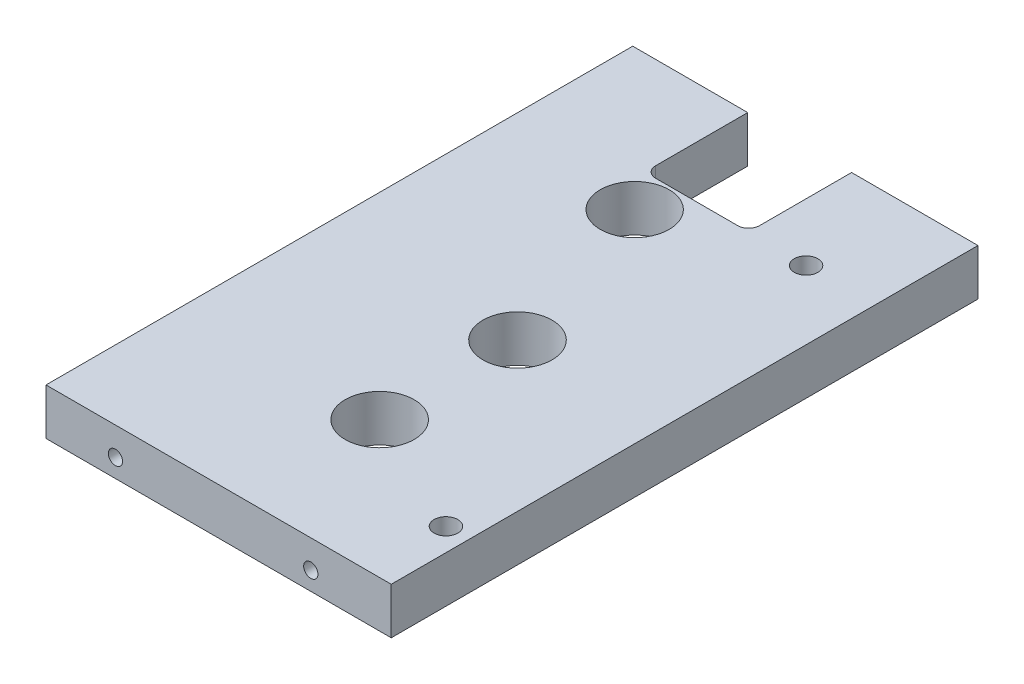
ISO-10303-21;
HEADER;
FILE_DESCRIPTION(('STEP AP214'),'2;1');
FILE_NAME('part.step','',(''),(''),'','','');
FILE_SCHEMA(('AUTOMOTIVE_DESIGN { 1 0 10303 214 1 1 1 1 }'));
ENDSEC;
DATA;
#1=APPLICATION_CONTEXT('core data for automotive mechanical design processes');
#2=APPLICATION_PROTOCOL_DEFINITION('international standard','automotive_design',2000,#1);
#3=PRODUCT_CONTEXT('',#1,'mechanical');
#4=PRODUCT('Part','Part','',(#3));
#5=PRODUCT_RELATED_PRODUCT_CATEGORY('part','',(#4));
#6=PRODUCT_DEFINITION_FORMATION('','',#4);
#7=PRODUCT_DEFINITION_CONTEXT('part definition',#1,'design');
#8=PRODUCT_DEFINITION('design','',#6,#7);
#9=PRODUCT_DEFINITION_SHAPE('','',#8);
#10=(LENGTH_UNIT() NAMED_UNIT(*) SI_UNIT(.MILLI.,.METRE.));
#11=(NAMED_UNIT(*) PLANE_ANGLE_UNIT() SI_UNIT($,.RADIAN.));
#12=(NAMED_UNIT(*) SI_UNIT($,.STERADIAN.) SOLID_ANGLE_UNIT());
#13=UNCERTAINTY_MEASURE_WITH_UNIT(LENGTH_MEASURE(1.E-05),#10,'distance_accuracy_value','');
#14=(GEOMETRIC_REPRESENTATION_CONTEXT(3) GLOBAL_UNCERTAINTY_ASSIGNED_CONTEXT((#13)) GLOBAL_UNIT_ASSIGNED_CONTEXT((#10,
#11,#12)) REPRESENTATION_CONTEXT('',''));
#15=CARTESIAN_POINT('',(0.,0.,0.));
#16=DIRECTION('',(0.,0.,1.));
#17=DIRECTION('',(1.,0.,0.));
#18=AXIS2_PLACEMENT_3D('',#15,#16,#17);
#19=CARTESIAN_POINT('',(-257.2,-82.5,28.9681240867132));
#20=DIRECTION('',(0.,0.,-1.));
#21=DIRECTION('',(-1.,0.,0.));
#22=AXIS2_PLACEMENT_3D('',#19,#20,#21);
#23=CYLINDRICAL_SURFACE('',#22,3.09999999999999);
#24=CARTESIAN_POINT('',(-257.2,-82.5,0.));
#25=DIRECTION('',(0.,0.,1.));
#26=DIRECTION('',(1.,0.,0.));
#27=AXIS2_PLACEMENT_3D('',#24,#25,#26);
#28=CIRCLE('',#27,3.09999999999999);
#29=CARTESIAN_POINT('',(-254.1,-82.5,0.));
#30=VERTEX_POINT('',#29);
#31=EDGE_CURVE('E219',#30,#30,#28,.T.);
#32=ORIENTED_EDGE('',*,*,#31,.F.);
#33=EDGE_LOOP('',(#32));
#34=FACE_BOUND('',#33,.T.);
#35=CARTESIAN_POINT('',(-257.2,-82.5,20.2));
#36=DIRECTION('',(0.,0.,1.));
#37=DIRECTION('',(1.,0.,0.));
#38=AXIS2_PLACEMENT_3D('',#35,#36,#37);
#39=CIRCLE('',#38,3.09999999999999);
#40=CARTESIAN_POINT('',(-256.848432083375,-85.58,20.2));
#41=VERTEX_POINT('',#40);
#42=CARTESIAN_POINT('',(-257.551567916625,-85.58,20.2));
#43=VERTEX_POINT('',#42);
#44=EDGE_CURVE('E140',#41,#43,#39,.T.);
#45=ORIENTED_EDGE('',*,*,#44,.T.);
#46=DIRECTION('',(0.,0.,-1.));
#47=VECTOR('',#46,1.);
#48=CARTESIAN_POINT('',(-257.551567916625,-85.58,28.9681240867132));
#49=LINE('',#48,#47);
#50=CARTESIAN_POINT('',(-257.551567916625,-85.58,19.8613272153188));
#51=VERTEX_POINT('',#50);
#52=EDGE_CURVE('E52',#43,#51,#49,.T.);
#53=ORIENTED_EDGE('',*,*,#52,.T.);
#54=CARTESIAN_POINT('',(-256.848432083375,-85.58,19.5693427331078));
#55=CARTESIAN_POINT('',(-256.907836533533,-85.5867825790089,19.5912680193791));
#56=CARTESIAN_POINT('',(-256.96719185592,-85.5918149847107,19.6138537564495));
#57=CARTESIAN_POINT('',(-257.085419115516,-85.5984451808167,19.6602024908549));
#58=CARTESIAN_POINT('',(-257.144291985608,-85.6000537146995,19.6839615656487));
#59=CARTESIAN_POINT('',(-257.261543057596,-85.599943539512,19.7326512016025));
#60=CARTESIAN_POINT('',(-257.319921276302,-85.5982249439608,19.7575817227653));
#61=CARTESIAN_POINT('',(-257.436197094981,-85.591539167004,19.8086127408628));
#62=CARTESIAN_POINT('',(-257.494092599788,-85.5865617621281,19.8347166781873));
#63=CARTESIAN_POINT('',(-257.551567916625,-85.58,19.8613272153188));
#64=B_SPLINE_CURVE_WITH_KNOTS('',3,(#54,#55,#56,#57,#58,#59,#60,#61,#62,#63),.UNSPECIFIED.,.F.,
.F.,(4,2,2,2,4),(0.,0.191016695142209,0.381433126124509,0.571843060357759,0.762853225634808),.UNSPECIFIED.);
#65=CARTESIAN_POINT('',(-256.848432083375,-85.58,19.5693427331078));
#66=VERTEX_POINT('',#65);
#67=EDGE_CURVE('E11',#66,#51,#64,.T.);
#68=ORIENTED_EDGE('',*,*,#67,.F.);
#69=DIRECTION('',(0.,0.,-1.));
#70=VECTOR('',#69,1.);
#71=CARTESIAN_POINT('',(-256.848432083375,-85.58,28.9681240867132));
#72=LINE('',#71,#70);
#73=EDGE_CURVE('E134',#66,#41,#72,.F.);
#74=ORIENTED_EDGE('',*,*,#73,.T.);
#75=EDGE_LOOP('',(#45,#53,#68,#74));
#76=FACE_BOUND('',#75,.T.);
#77=ADVANCED_FACE('F32',(#34,#76),#23,.F.);
#78=CARTESIAN_POINT('',(-282.25,-691.394504988286,20.2));
#79=DIRECTION('',(0.,0.,1.));
#80=DIRECTION('',(1.,0.,0.));
#81=AXIS2_PLACEMENT_3D('',#78,#79,#80);
#82=PLANE('',#81);
#83=DIRECTION('',(1.,0.,0.));
#84=VECTOR('',#83,1.);
#85=CARTESIAN_POINT('',(-282.25,-85.58,20.2));
#86=LINE('',#85,#84);
#87=EDGE_CURVE('E146',#43,#41,#86,.T.);
#88=ORIENTED_EDGE('',*,*,#87,.F.);
#89=ORIENTED_EDGE('',*,*,#44,.F.);
#90=EDGE_LOOP('',(#88,#89));
#91=FACE_BOUND('',#90,.T.);
#92=ADVANCED_FACE('F358',(#91),#82,.F.);
#93=CARTESIAN_POINT('',(-253.55,-88.901,28.505));
#94=DIRECTION('',(0.,1.,0.));
#95=DIRECTION('',(-1.,0.,0.));
#96=AXIS2_PLACEMENT_3D('',#93,#94,#95);
#97=CYLINDRICAL_SURFACE('',#96,3.26500000000004);
#98=CARTESIAN_POINT('',(-253.55,-76.1000000000001,28.505));
#99=DIRECTION('',(0.,1.,0.));
#100=DIRECTION('',(-1.,0.,0.));
#101=AXIS2_PLACEMENT_3D('',#98,#99,#100);
#102=CIRCLE('',#101,3.26500000000004);
#103=CARTESIAN_POINT('',(-256.815,-76.1000000000001,28.505));
#104=VERTEX_POINT('',#103);
#105=EDGE_CURVE('E151',#104,#104,#102,.T.);
#106=ORIENTED_EDGE('',*,*,#105,.T.);
#107=EDGE_LOOP('',(#106));
#108=FACE_BOUND('',#107,.T.);
#109=CARTESIAN_POINT('',(-253.55,-85.58,28.505));
#110=DIRECTION('',(0.,-1.,0.));
#111=DIRECTION('',(1.,0.,0.));
#112=AXIS2_PLACEMENT_3D('',#109,#110,#111);
#113=CIRCLE('',#112,3.26500000000004);
#114=CARTESIAN_POINT('',(-250.285,-85.58,28.505));
#115=VERTEX_POINT('',#114);
#116=EDGE_CURVE('E135',#115,#115,#113,.F.);
#117=ORIENTED_EDGE('',*,*,#116,.F.);
#118=EDGE_LOOP('',(#117));
#119=FACE_BOUND('',#118,.T.);
#120=ADVANCED_FACE('F363',(#108,#119),#97,.F.);
#121=CARTESIAN_POINT('',(-234.625,-76.1,0.));
#122=DIRECTION('',(0.,0.,1.));
#123=DIRECTION('',(1.,0.,0.));
#124=AXIS2_PLACEMENT_3D('',#121,#122,#123);
#125=PLANE('',#124);
#126=CARTESIAN_POINT('',(-320.5,-82.5,0.));
#127=DIRECTION('',(0.,0.,1.));
#128=DIRECTION('',(1.,0.,0.));
#129=AXIS2_PLACEMENT_3D('',#126,#127,#128);
#130=CIRCLE('',#129,2.39499999999998);
#131=CARTESIAN_POINT('',(-318.105,-82.5,0.));
#132=VERTEX_POINT('',#131);
#133=EDGE_CURVE('E207',#132,#132,#130,.T.);
#134=ORIENTED_EDGE('',*,*,#133,.T.);
#135=EDGE_LOOP('',(#134));
#136=FACE_BOUND('',#135,.T.);
#137=CARTESIAN_POINT('',(-308.,-82.5,0.));
#138=DIRECTION('',(0.,0.,1.));
#139=DIRECTION('',(1.,0.,0.));
#140=AXIS2_PLACEMENT_3D('',#137,#138,#139);
#141=CIRCLE('',#140,3.09999999999999);
#142=CARTESIAN_POINT('',(-304.9,-82.5,0.));
#143=VERTEX_POINT('',#142);
#144=EDGE_CURVE('E223',#143,#143,#141,.T.);
#145=ORIENTED_EDGE('',*,*,#144,.T.);
#146=EDGE_LOOP('',(#145));
#147=FACE_BOUND('',#146,.T.);
#148=DIRECTION('',(-1.,0.,0.));
#149=VECTOR('',#148,1.);
#150=CARTESIAN_POINT('',(-234.625,-76.1,0.));
#151=LINE('',#150,#149);
#152=CARTESIAN_POINT('',(-298.155,-76.1000000000001,0.));
#153=VERTEX_POINT('',#152);
#154=CARTESIAN_POINT('',(-329.875,-76.1000000000001,0.));
#155=VERTEX_POINT('',#154);
#156=EDGE_CURVE('E242',#153,#155,#151,.T.);
#157=ORIENTED_EDGE('',*,*,#156,.F.);
#158=DIRECTION('',(0.,1.,0.));
#159=VECTOR('',#158,1.);
#160=CARTESIAN_POINT('',(-298.155,-88.901,0.));
#161=LINE('',#160,#159);
#162=CARTESIAN_POINT('',(-298.155,-88.9,0.));
#163=VERTEX_POINT('',#162);
#164=EDGE_CURVE('E199',#163,#153,#161,.T.);
#165=ORIENTED_EDGE('',*,*,#164,.F.);
#166=DIRECTION('',(-1.,0.,0.));
#167=VECTOR('',#166,1.);
#168=CARTESIAN_POINT('',(-234.625,-88.8999999999999,0.));
#169=LINE('',#168,#167);
#170=CARTESIAN_POINT('',(-329.875,-88.9,0.));
#171=VERTEX_POINT('',#170);
#172=EDGE_CURVE('E234',#163,#171,#169,.T.);
#173=ORIENTED_EDGE('',*,*,#172,.T.);
#174=DIRECTION('',(0.,1.,0.));
#175=VECTOR('',#174,1.);
#176=CARTESIAN_POINT('',(-329.875,-88.9,0.));
#177=LINE('',#176,#175);
#178=EDGE_CURVE('E233',#171,#155,#177,.T.);
#179=ORIENTED_EDGE('',*,*,#178,.T.);
#180=EDGE_LOOP('',(#157,#165,#173,#179));
#181=FACE_BOUND('',#180,.T.);
#182=ADVANCED_FACE('F322',(#136,#147,#181),#125,.F.);
#183=CARTESIAN_POINT('',(-244.2,-82.5,0.));
#184=DIRECTION('',(0.,0.,1.));
#185=DIRECTION('',(1.,0.,0.));
#186=AXIS2_PLACEMENT_3D('',#183,#184,#185);
#187=CIRCLE('',#186,2.39499999999998);
#188=CARTESIAN_POINT('',(-241.805,-82.5,0.));
#189=VERTEX_POINT('',#188);
#190=EDGE_CURVE('E213',#189,#189,#187,.T.);
#191=ORIENTED_EDGE('',*,*,#190,.T.);
#192=EDGE_LOOP('',(#191));
#193=FACE_BOUND('',#192,.T.);
#194=CARTESIAN_POINT('',(-234.625,-88.8999999999999,0.));
#195=VERTEX_POINT('',#194);
#196=CARTESIAN_POINT('',(-269.505,-88.8999999999999,0.));
#197=VERTEX_POINT('',#196);
#198=EDGE_CURVE('E230',#195,#197,#169,.T.);
#199=ORIENTED_EDGE('',*,*,#198,.T.);
#200=DIRECTION('',(0.,1.,0.));
#201=VECTOR('',#200,1.);
#202=CARTESIAN_POINT('',(-269.505,-88.901,0.));
#203=LINE('',#202,#201);
#204=CARTESIAN_POINT('',(-269.505,-76.1000000000001,0.));
#205=VERTEX_POINT('',#204);
#206=EDGE_CURVE('E201',#197,#205,#203,.T.);
#207=ORIENTED_EDGE('',*,*,#206,.T.);
#208=CARTESIAN_POINT('',(-234.625,-76.1,0.));
#209=VERTEX_POINT('',#208);
#210=EDGE_CURVE('E238',#209,#205,#151,.T.);
#211=ORIENTED_EDGE('',*,*,#210,.F.);
#212=DIRECTION('',(0.,1.,0.));
#213=VECTOR('',#212,1.);
#214=CARTESIAN_POINT('',(-234.625,-88.8999999999999,0.));
#215=LINE('',#214,#213);
#216=EDGE_CURVE('E45',#195,#209,#215,.T.);
#217=ORIENTED_EDGE('',*,*,#216,.F.);
#218=EDGE_LOOP('',(#199,#207,#211,#217));
#219=FACE_BOUND('',#218,.T.);
#220=ORIENTED_EDGE('',*,*,#31,.T.);
#221=EDGE_LOOP('',(#220));
#222=FACE_BOUND('',#221,.T.);
#223=ADVANCED_FACE('F338',(#193,#219,#222),#125,.F.);
#224=CARTESIAN_POINT('',(-329.875,-610.1,161.88));
#225=DIRECTION('',(0.,0.,1.));
#226=DIRECTION('',(1.,0.,0.));
#227=AXIS2_PLACEMENT_3D('',#224,#225,#226);
#228=PLANE('',#227);
#229=CARTESIAN_POINT('',(-310.715,-83.83,161.88));
#230=DIRECTION('',(0.,0.,1.));
#231=DIRECTION('',(1.,0.,0.));
#232=AXIS2_PLACEMENT_3D('',#229,#230,#231);
#233=CIRCLE('',#232,1.965);
#234=CARTESIAN_POINT('',(-308.75,-83.83,161.88));
#235=VERTEX_POINT('',#234);
#236=EDGE_CURVE('E275',#235,#235,#233,.T.);
#237=ORIENTED_EDGE('',*,*,#236,.F.);
#238=EDGE_LOOP('',(#237));
#239=FACE_BOUND('',#238,.T.);
#240=CARTESIAN_POINT('',(-256.825,-83.83,161.88));
#241=DIRECTION('',(0.,0.,1.));
#242=DIRECTION('',(1.,0.,0.));
#243=AXIS2_PLACEMENT_3D('',#240,#241,#242);
#244=CIRCLE('',#243,1.965);
#245=CARTESIAN_POINT('',(-254.86,-83.83,161.88));
#246=VERTEX_POINT('',#245);
#247=EDGE_CURVE('E269',#246,#246,#244,.T.);
#248=ORIENTED_EDGE('',*,*,#247,.F.);
#249=EDGE_LOOP('',(#248));
#250=FACE_BOUND('',#249,.T.);
#251=DIRECTION('',(-1.,0.,0.));
#252=VECTOR('',#251,1.);
#253=CARTESIAN_POINT('',(-234.625,-88.8999999999999,161.88));
#254=LINE('',#253,#252);
#255=CARTESIAN_POINT('',(-234.625,-88.8999999999999,161.88));
#256=VERTEX_POINT('',#255);
#257=CARTESIAN_POINT('',(-329.875,-88.9,161.88));
#258=VERTEX_POINT('',#257);
#259=EDGE_CURVE('E237',#256,#258,#254,.T.);
#260=ORIENTED_EDGE('',*,*,#259,.F.);
#261=DIRECTION('',(0.,1.,0.));
#262=VECTOR('',#261,1.);
#263=CARTESIAN_POINT('',(-234.625,-88.8999999999999,161.88));
#264=LINE('',#263,#262);
#265=CARTESIAN_POINT('',(-234.625,-76.1,161.88));
#266=VERTEX_POINT('',#265);
#267=EDGE_CURVE('E229',#256,#266,#264,.T.);
#268=ORIENTED_EDGE('',*,*,#267,.T.);
#269=DIRECTION('',(-1.,0.,0.));
#270=VECTOR('',#269,1.);
#271=CARTESIAN_POINT('',(-234.625,-76.1,161.88));
#272=LINE('',#271,#270);
#273=CARTESIAN_POINT('',(-329.875,-76.1000000000001,161.88));
#274=VERTEX_POINT('',#273);
#275=EDGE_CURVE('E249',#266,#274,#272,.T.);
#276=ORIENTED_EDGE('',*,*,#275,.T.);
#277=DIRECTION('',(0.,1.,0.));
#278=VECTOR('',#277,1.);
#279=CARTESIAN_POINT('',(-329.875,-88.9,161.88));
#280=LINE('',#279,#278);
#281=EDGE_CURVE('E251',#258,#274,#280,.T.);
#282=ORIENTED_EDGE('',*,*,#281,.F.);
#283=EDGE_LOOP('',(#260,#268,#276,#282));
#284=FACE_BOUND('',#283,.T.);
#285=ADVANCED_FACE('F34',(#239,#250,#284),#228,.T.);
#286=CARTESIAN_POINT('',(-234.625,-88.8999999999999,257.98620427423));
#287=DIRECTION('',(0.,-1.,0.));
#288=DIRECTION('',(1.,0.,0.));
#289=AXIS2_PLACEMENT_3D('',#286,#287,#288);
#290=PLANE('',#289);
#291=CARTESIAN_POINT('',(-290.57,-88.9,38.77));
#292=DIRECTION('',(0.,1.,0.));
#293=DIRECTION('',(-1.,0.,0.));
#294=AXIS2_PLACEMENT_3D('',#291,#292,#293);
#295=CIRCLE('',#294,9.50000000000001);
#296=CARTESIAN_POINT('',(-300.07,-88.9,38.77));
#297=VERTEX_POINT('',#296);
#298=EDGE_CURVE('E278',#297,#297,#295,.T.);
#299=ORIENTED_EDGE('',*,*,#298,.T.);
#300=EDGE_LOOP('',(#299));
#301=FACE_BOUND('',#300,.T.);
#302=CARTESIAN_POINT('',(-253.55,-88.9,28.505));
#303=DIRECTION('',(0.,-1.,0.));
#304=DIRECTION('',(1.,0.,0.));
#305=AXIS2_PLACEMENT_3D('',#302,#303,#304);
#306=CIRCLE('',#305,9.52500000000002);
#307=CARTESIAN_POINT('',(-244.025,-88.9,28.505));
#308=VERTEX_POINT('',#307);
#309=EDGE_CURVE('E136',#308,#308,#306,.T.);
#310=ORIENTED_EDGE('',*,*,#309,.F.);
#311=EDGE_LOOP('',(#310));
#312=FACE_BOUND('',#311,.T.);
#313=CARTESIAN_POINT('',(-240.925,-88.8999999999999,140.49));
#314=DIRECTION('',(0.,-1.,0.));
#315=DIRECTION('',(1.,0.,0.));
#316=AXIS2_PLACEMENT_3D('',#313,#314,#315);
#317=CIRCLE('',#316,3.26500000000004);
#318=CARTESIAN_POINT('',(-237.66,-88.8999999999999,140.49));
#319=VERTEX_POINT('',#318);
#320=EDGE_CURVE('E141',#319,#319,#317,.F.);
#321=ORIENTED_EDGE('',*,*,#320,.T.);
#322=EDGE_LOOP('',(#321));
#323=FACE_BOUND('',#322,.T.);
#324=CARTESIAN_POINT('',(-275.57,-88.8999999999999,124.135));
#325=DIRECTION('',(0.,-1.,0.));
#326=DIRECTION('',(1.,0.,0.));
#327=AXIS2_PLACEMENT_3D('',#324,#325,#326);
#328=CIRCLE('',#327,9.52500000000002);
#329=CARTESIAN_POINT('',(-266.045,-88.8999999999999,124.135));
#330=VERTEX_POINT('',#329);
#331=EDGE_CURVE('E155',#330,#330,#328,.F.);
#332=ORIENTED_EDGE('',*,*,#331,.T.);
#333=EDGE_LOOP('',(#332));
#334=FACE_BOUND('',#333,.T.);
#335=CARTESIAN_POINT('',(-275.57,-88.8999999999999,86.105));
#336=DIRECTION('',(0.,-1.,0.));
#337=DIRECTION('',(1.,0.,0.));
#338=AXIS2_PLACEMENT_3D('',#335,#336,#337);
#339=CIRCLE('',#338,9.52500000000002);
#340=CARTESIAN_POINT('',(-266.045,-88.8999999999999,86.105));
#341=VERTEX_POINT('',#340);
#342=EDGE_CURVE('E159',#341,#341,#339,.F.);
#343=ORIENTED_EDGE('',*,*,#342,.T.);
#344=EDGE_LOOP('',(#343));
#345=FACE_BOUND('',#344,.T.);
#346=DIRECTION('',(0.,0.,1.));
#347=VECTOR('',#346,1.);
#348=CARTESIAN_POINT('',(-298.155,-88.9,0.));
#349=LINE('',#348,#347);
#350=CARTESIAN_POINT('',(-298.155,-88.9,25.4));
#351=VERTEX_POINT('',#350);
#352=EDGE_CURVE('E176',#163,#351,#349,.T.);
#353=ORIENTED_EDGE('',*,*,#352,.T.);
#354=CARTESIAN_POINT('',(-295.155,-88.9,25.4));
#355=DIRECTION('',(0.,-1.,0.));
#356=DIRECTION('',(1.,0.,0.));
#357=AXIS2_PLACEMENT_3D('',#354,#355,#356);
#358=CIRCLE('',#357,3.);
#359=CARTESIAN_POINT('',(-295.155,-88.9,28.4));
#360=VERTEX_POINT('',#359);
#361=EDGE_CURVE('E173',#351,#360,#358,.F.);
#362=ORIENTED_EDGE('',*,*,#361,.T.);
#363=DIRECTION('',(1.,0.,0.));
#364=VECTOR('',#363,1.);
#365=CARTESIAN_POINT('',(-295.155,-88.9,28.4));
#366=LINE('',#365,#364);
#367=CARTESIAN_POINT('',(-272.505,-88.8999999999999,28.4));
#368=VERTEX_POINT('',#367);
#369=EDGE_CURVE('E170',#360,#368,#366,.T.);
#370=ORIENTED_EDGE('',*,*,#369,.T.);
#371=CARTESIAN_POINT('',(-272.505,-88.8999999999999,25.4));
#372=DIRECTION('',(0.,-1.,0.));
#373=DIRECTION('',(1.,0.,0.));
#374=AXIS2_PLACEMENT_3D('',#371,#372,#373);
#375=CIRCLE('',#374,3.);
#376=CARTESIAN_POINT('',(-269.505,-88.8999999999999,25.4));
#377=VERTEX_POINT('',#376);
#378=EDGE_CURVE('E165',#368,#377,#375,.F.);
#379=ORIENTED_EDGE('',*,*,#378,.T.);
#380=DIRECTION('',(0.,0.,-1.));
#381=VECTOR('',#380,1.);
#382=CARTESIAN_POINT('',(-269.505,-88.8999999999999,25.4));
#383=LINE('',#382,#381);
#384=EDGE_CURVE('E194',#377,#197,#383,.T.);
#385=ORIENTED_EDGE('',*,*,#384,.T.);
#386=ORIENTED_EDGE('',*,*,#198,.F.);
#387=DIRECTION('',(0.,0.,-1.));
#388=VECTOR('',#387,1.);
#389=CARTESIAN_POINT('',(-234.625,-88.8999999999999,257.98620427423));
#390=LINE('',#389,#388);
#391=EDGE_CURVE('E241',#256,#195,#390,.T.);
#392=ORIENTED_EDGE('',*,*,#391,.F.);
#393=ORIENTED_EDGE('',*,*,#259,.T.);
#394=DIRECTION('',(0.,0.,-1.));
#395=VECTOR('',#394,1.);
#396=CARTESIAN_POINT('',(-329.875,-88.9,257.98620427423));
#397=LINE('',#396,#395);
#398=EDGE_CURVE('E247',#258,#171,#397,.T.);
#399=ORIENTED_EDGE('',*,*,#398,.T.);
#400=ORIENTED_EDGE('',*,*,#172,.F.);
#401=EDGE_LOOP('',(#353,#362,#370,#379,#385,#386,#392,#393,#399,#400));
#402=FACE_BOUND('',#401,.T.);
#403=ADVANCED_FACE('F285',(#301,#312,#323,#334,#345,#402),#290,.T.);
#404=CARTESIAN_POINT('',(-329.875,-88.9,257.98620427423));
#405=DIRECTION('',(-1.,0.,0.));
#406=DIRECTION('',(0.,0.,1.));
#407=AXIS2_PLACEMENT_3D('',#404,#405,#406);
#408=PLANE('',#407);
#409=ORIENTED_EDGE('',*,*,#398,.F.);
#410=ORIENTED_EDGE('',*,*,#281,.T.);
#411=DIRECTION('',(0.,0.,-1.));
#412=VECTOR('',#411,1.);
#413=CARTESIAN_POINT('',(-329.875,-76.1000000000001,257.98620427423));
#414=LINE('',#413,#412);
#415=EDGE_CURVE('E254',#274,#155,#414,.T.);
#416=ORIENTED_EDGE('',*,*,#415,.T.);
#417=ORIENTED_EDGE('',*,*,#178,.F.);
#418=EDGE_LOOP('',(#409,#410,#416,#417));
#419=FACE_BOUND('',#418,.T.);
#420=ADVANCED_FACE('F299',(#419),#408,.T.);
#421=CARTESIAN_POINT('',(-234.625,-76.1,257.98620427423));
#422=DIRECTION('',(0.,-1.,0.));
#423=DIRECTION('',(1.,0.,0.));
#424=AXIS2_PLACEMENT_3D('',#421,#422,#423);
#425=PLANE('',#424);
#426=CARTESIAN_POINT('',(-290.57,-76.1000000000001,38.77));
#427=DIRECTION('',(0.,1.,0.));
#428=DIRECTION('',(-1.,0.,0.));
#429=AXIS2_PLACEMENT_3D('',#426,#427,#428);
#430=CIRCLE('',#429,9.50000000000001);
#431=CARTESIAN_POINT('',(-300.07,-76.1000000000001,38.77));
#432=VERTEX_POINT('',#431);
#433=EDGE_CURVE('E279',#432,#432,#430,.T.);
#434=ORIENTED_EDGE('',*,*,#433,.F.);
#435=EDGE_LOOP('',(#434));
#436=FACE_BOUND('',#435,.T.);
#437=CARTESIAN_POINT('',(-240.925,-76.1000000000001,140.49));
#438=DIRECTION('',(0.,1.,0.));
#439=DIRECTION('',(-1.,0.,0.));
#440=AXIS2_PLACEMENT_3D('',#437,#438,#439);
#441=CIRCLE('',#440,3.26500000000004);
#442=CARTESIAN_POINT('',(-244.19,-76.1000000000001,140.49));
#443=VERTEX_POINT('',#442);
#444=EDGE_CURVE('E144',#443,#443,#441,.T.);
#445=ORIENTED_EDGE('',*,*,#444,.F.);
#446=EDGE_LOOP('',(#445));
#447=FACE_BOUND('',#446,.T.);
#448=ORIENTED_EDGE('',*,*,#105,.F.);
#449=EDGE_LOOP('',(#448));
#450=FACE_BOUND('',#449,.T.);
#451=CARTESIAN_POINT('',(-275.57,-76.1000000000001,124.135));
#452=DIRECTION('',(0.,1.,0.));
#453=DIRECTION('',(-1.,0.,0.));
#454=AXIS2_PLACEMENT_3D('',#451,#452,#453);
#455=CIRCLE('',#454,9.52500000000002);
#456=CARTESIAN_POINT('',(-285.095,-76.1000000000001,124.135));
#457=VERTEX_POINT('',#456);
#458=EDGE_CURVE('E156',#457,#457,#455,.T.);
#459=ORIENTED_EDGE('',*,*,#458,.F.);
#460=EDGE_LOOP('',(#459));
#461=FACE_BOUND('',#460,.T.);
#462=CARTESIAN_POINT('',(-275.57,-76.1000000000001,86.105));
#463=DIRECTION('',(0.,1.,0.));
#464=DIRECTION('',(-1.,0.,0.));
#465=AXIS2_PLACEMENT_3D('',#462,#463,#464);
#466=CIRCLE('',#465,9.52500000000002);
#467=CARTESIAN_POINT('',(-285.095,-76.1000000000001,86.105));
#468=VERTEX_POINT('',#467);
#469=EDGE_CURVE('E162',#468,#468,#466,.T.);
#470=ORIENTED_EDGE('',*,*,#469,.F.);
#471=EDGE_LOOP('',(#470));
#472=FACE_BOUND('',#471,.T.);
#473=CARTESIAN_POINT('',(-295.155,-76.1000000000001,25.4));
#474=DIRECTION('',(0.,1.,0.));
#475=DIRECTION('',(-1.,0.,0.));
#476=AXIS2_PLACEMENT_3D('',#473,#474,#475);
#477=CIRCLE('',#476,3.);
#478=CARTESIAN_POINT('',(-298.155,-76.1000000000001,25.4));
#479=VERTEX_POINT('',#478);
#480=CARTESIAN_POINT('',(-295.155,-76.1000000000001,28.4));
#481=VERTEX_POINT('',#480);
#482=EDGE_CURVE('E185',#479,#481,#477,.T.);
#483=ORIENTED_EDGE('',*,*,#482,.F.);
#484=DIRECTION('',(0.,0.,1.));
#485=VECTOR('',#484,1.);
#486=CARTESIAN_POINT('',(-298.155,-76.1000000000001,0.));
#487=LINE('',#486,#485);
#488=EDGE_CURVE('E182',#153,#479,#487,.T.);
#489=ORIENTED_EDGE('',*,*,#488,.F.);
#490=ORIENTED_EDGE('',*,*,#156,.T.);
#491=ORIENTED_EDGE('',*,*,#415,.F.);
#492=ORIENTED_EDGE('',*,*,#275,.F.);
#493=DIRECTION('',(0.,0.,-1.));
#494=VECTOR('',#493,1.);
#495=CARTESIAN_POINT('',(-234.625,-76.1,257.98620427423));
#496=LINE('',#495,#494);
#497=EDGE_CURVE('E255',#266,#209,#496,.T.);
#498=ORIENTED_EDGE('',*,*,#497,.T.);
#499=ORIENTED_EDGE('',*,*,#210,.T.);
#500=DIRECTION('',(0.,0.,-1.));
#501=VECTOR('',#500,1.);
#502=CARTESIAN_POINT('',(-269.505,-76.1000000000001,25.4));
#503=LINE('',#502,#501);
#504=CARTESIAN_POINT('',(-269.505,-76.1,25.4));
#505=VERTEX_POINT('',#504);
#506=EDGE_CURVE('E180',#505,#205,#503,.T.);
#507=ORIENTED_EDGE('',*,*,#506,.F.);
#508=CARTESIAN_POINT('',(-272.505,-76.1000000000001,25.4));
#509=DIRECTION('',(0.,1.,0.));
#510=DIRECTION('',(-1.,0.,0.));
#511=AXIS2_PLACEMENT_3D('',#508,#509,#510);
#512=CIRCLE('',#511,3.);
#513=CARTESIAN_POINT('',(-272.505,-76.1000000000001,28.4));
#514=VERTEX_POINT('',#513);
#515=EDGE_CURVE('E60',#514,#505,#512,.T.);
#516=ORIENTED_EDGE('',*,*,#515,.F.);
#517=DIRECTION('',(1.,0.,0.));
#518=VECTOR('',#517,1.);
#519=CARTESIAN_POINT('',(-295.155,-76.1000000000001,28.4));
#520=LINE('',#519,#518);
#521=EDGE_CURVE('E188',#481,#514,#520,.T.);
#522=ORIENTED_EDGE('',*,*,#521,.F.);
#523=EDGE_LOOP('',(#483,#489,#490,#491,#492,#498,#499,#507,#516,#522));
#524=FACE_BOUND('',#523,.T.);
#525=ADVANCED_FACE('F295',(#436,#447,#450,#461,#472,#524),#425,.F.);
#526=CARTESIAN_POINT('',(-234.625,-88.8999999999999,257.98620427423));
#527=DIRECTION('',(-1.,0.,0.));
#528=DIRECTION('',(0.,0.,1.));
#529=AXIS2_PLACEMENT_3D('',#526,#527,#528);
#530=PLANE('',#529);
#531=ORIENTED_EDGE('',*,*,#267,.F.);
#532=ORIENTED_EDGE('',*,*,#391,.T.);
#533=ORIENTED_EDGE('',*,*,#216,.T.);
#534=ORIENTED_EDGE('',*,*,#497,.F.);
#535=EDGE_LOOP('',(#531,#532,#533,#534));
#536=FACE_BOUND('',#535,.T.);
#537=ADVANCED_FACE('F298',(#536),#530,.F.);
#538=CARTESIAN_POINT('',(-308.,-82.5,28.9681240867132));
#539=DIRECTION('',(0.,0.,-1.));
#540=DIRECTION('',(-1.,0.,0.));
#541=AXIS2_PLACEMENT_3D('',#538,#539,#540);
#542=CYLINDRICAL_SURFACE('',#541,3.09999999999999);
#543=ORIENTED_EDGE('',*,*,#144,.F.);
#544=EDGE_LOOP('',(#543));
#545=FACE_BOUND('',#544,.T.);
#546=CARTESIAN_POINT('',(-308.,-82.5,20.2));
#547=DIRECTION('',(0.,0.,1.));
#548=DIRECTION('',(1.,0.,0.));
#549=AXIS2_PLACEMENT_3D('',#546,#547,#548);
#550=CIRCLE('',#549,3.09999999999999);
#551=CARTESIAN_POINT('',(-304.9,-82.5,20.2));
#552=VERTEX_POINT('',#551);
#553=EDGE_CURVE('E226',#552,#552,#550,.T.);
#554=ORIENTED_EDGE('',*,*,#553,.T.);
#555=EDGE_LOOP('',(#554));
#556=FACE_BOUND('',#555,.T.);
#557=ADVANCED_FACE('F372',(#545,#556),#542,.F.);
#558=CARTESIAN_POINT('',(-282.25,-691.394504988286,20.2));
#559=DIRECTION('',(0.,0.,1.));
#560=DIRECTION('',(1.,0.,0.));
#561=AXIS2_PLACEMENT_3D('',#558,#559,#560);
#562=PLANE('',#561);
#563=ORIENTED_EDGE('',*,*,#553,.F.);
#564=EDGE_LOOP('',(#563));
#565=FACE_BOUND('',#564,.T.);
#566=ADVANCED_FACE('F375',(#565),#562,.F.);
#567=CARTESIAN_POINT('',(-244.2,-82.5,28.2740829637671));
#568=DIRECTION('',(0.,0.,-1.));
#569=DIRECTION('',(-1.,0.,0.));
#570=AXIS2_PLACEMENT_3D('',#567,#568,#569);
#571=CYLINDRICAL_SURFACE('',#570,2.39499999999998);
#572=ORIENTED_EDGE('',*,*,#190,.F.);
#573=EDGE_LOOP('',(#572));
#574=FACE_BOUND('',#573,.T.);
#575=CARTESIAN_POINT('',(-244.2,-82.5,21.5));
#576=DIRECTION('',(0.,0.,1.));
#577=DIRECTION('',(1.,0.,0.));
#578=AXIS2_PLACEMENT_3D('',#575,#576,#577);
#579=CIRCLE('',#578,2.39499999999998);
#580=CARTESIAN_POINT('',(-241.805,-82.5,21.5));
#581=VERTEX_POINT('',#580);
#582=EDGE_CURVE('E216',#581,#581,#579,.T.);
#583=ORIENTED_EDGE('',*,*,#582,.T.);
#584=EDGE_LOOP('',(#583));
#585=FACE_BOUND('',#584,.T.);
#586=ADVANCED_FACE('F379',(#574,#585),#571,.F.);
#587=CARTESIAN_POINT('',(-282.25,-691.394504988286,21.5));
#588=DIRECTION('',(0.,0.,1.));
#589=DIRECTION('',(1.,0.,0.));
#590=AXIS2_PLACEMENT_3D('',#587,#588,#589);
#591=PLANE('',#590);
#592=ORIENTED_EDGE('',*,*,#582,.F.);
#593=EDGE_LOOP('',(#592));
#594=FACE_BOUND('',#593,.T.);
#595=ADVANCED_FACE('F369',(#594),#591,.F.);
#596=CARTESIAN_POINT('',(-320.5,-82.5,28.2740829637671));
#597=DIRECTION('',(0.,0.,-1.));
#598=DIRECTION('',(-1.,0.,0.));
#599=AXIS2_PLACEMENT_3D('',#596,#597,#598);
#600=CYLINDRICAL_SURFACE('',#599,2.39499999999998);
#601=ORIENTED_EDGE('',*,*,#133,.F.);
#602=EDGE_LOOP('',(#601));
#603=FACE_BOUND('',#602,.T.);
#604=CARTESIAN_POINT('',(-320.5,-82.5,21.5));
#605=DIRECTION('',(0.,0.,1.));
#606=DIRECTION('',(1.,0.,0.));
#607=AXIS2_PLACEMENT_3D('',#604,#605,#606);
#608=CIRCLE('',#607,2.39499999999998);
#609=CARTESIAN_POINT('',(-318.105,-82.5,21.5));
#610=VERTEX_POINT('',#609);
#611=EDGE_CURVE('E210',#610,#610,#608,.T.);
#612=ORIENTED_EDGE('',*,*,#611,.T.);
#613=EDGE_LOOP('',(#612));
#614=FACE_BOUND('',#613,.T.);
#615=ADVANCED_FACE('F440',(#603,#614),#600,.F.);
#616=CARTESIAN_POINT('',(-282.25,-691.394504988286,21.5));
#617=DIRECTION('',(0.,0.,1.));
#618=DIRECTION('',(1.,0.,0.));
#619=AXIS2_PLACEMENT_3D('',#616,#617,#618);
#620=PLANE('',#619);
#621=ORIENTED_EDGE('',*,*,#611,.F.);
#622=EDGE_LOOP('',(#621));
#623=FACE_BOUND('',#622,.T.);
#624=ADVANCED_FACE('F354',(#623),#620,.F.);
#625=CARTESIAN_POINT('',(-272.505,-88.901,25.4));
#626=DIRECTION('',(0.,1.,0.));
#627=DIRECTION('',(-1.,0.,0.));
#628=AXIS2_PLACEMENT_3D('',#625,#626,#627);
#629=CYLINDRICAL_SURFACE('',#628,3.);
#630=DIRECTION('',(0.,1.,0.));
#631=VECTOR('',#630,1.);
#632=CARTESIAN_POINT('',(-272.505,-88.901,28.4));
#633=LINE('',#632,#631);
#634=EDGE_CURVE('E192',#368,#514,#633,.T.);
#635=ORIENTED_EDGE('',*,*,#634,.T.);
#636=ORIENTED_EDGE('',*,*,#515,.T.);
#637=DIRECTION('',(0.,1.,0.));
#638=VECTOR('',#637,1.);
#639=CARTESIAN_POINT('',(-269.505,-88.901,25.4));
#640=LINE('',#639,#638);
#641=EDGE_CURVE('E191',#377,#505,#640,.T.);
#642=ORIENTED_EDGE('',*,*,#641,.F.);
#643=ORIENTED_EDGE('',*,*,#378,.F.);
#644=EDGE_LOOP('',(#635,#636,#642,#643));
#645=FACE_BOUND('',#644,.T.);
#646=ADVANCED_FACE('F343',(#645),#629,.F.);
#647=CARTESIAN_POINT('',(-295.155,-88.901,28.4));
#648=DIRECTION('',(0.,0.,1.));
#649=DIRECTION('',(1.,0.,0.));
#650=AXIS2_PLACEMENT_3D('',#647,#648,#649);
#651=PLANE('',#650);
#652=DIRECTION('',(0.,1.,0.));
#653=VECTOR('',#652,1.);
#654=CARTESIAN_POINT('',(-295.155,-88.901,28.4));
#655=LINE('',#654,#653);
#656=EDGE_CURVE('E195',#360,#481,#655,.T.);
#657=ORIENTED_EDGE('',*,*,#656,.T.);
#658=ORIENTED_EDGE('',*,*,#521,.T.);
#659=ORIENTED_EDGE('',*,*,#634,.F.);
#660=ORIENTED_EDGE('',*,*,#369,.F.);
#661=EDGE_LOOP('',(#657,#658,#659,#660));
#662=FACE_BOUND('',#661,.T.);
#663=ADVANCED_FACE('F346',(#662),#651,.F.);
#664=CARTESIAN_POINT('',(-295.155,-88.901,25.4));
#665=DIRECTION('',(0.,1.,0.));
#666=DIRECTION('',(-1.,0.,0.));
#667=AXIS2_PLACEMENT_3D('',#664,#665,#666);
#668=CYLINDRICAL_SURFACE('',#667,3.);
#669=DIRECTION('',(0.,1.,0.));
#670=VECTOR('',#669,1.);
#671=CARTESIAN_POINT('',(-298.155,-88.901,25.4));
#672=LINE('',#671,#670);
#673=EDGE_CURVE('E197',#351,#479,#672,.T.);
#674=ORIENTED_EDGE('',*,*,#673,.T.);
#675=ORIENTED_EDGE('',*,*,#482,.T.);
#676=ORIENTED_EDGE('',*,*,#656,.F.);
#677=ORIENTED_EDGE('',*,*,#361,.F.);
#678=EDGE_LOOP('',(#674,#675,#676,#677));
#679=FACE_BOUND('',#678,.T.);
#680=ADVANCED_FACE('F315',(#679),#668,.F.);
#681=CARTESIAN_POINT('',(-298.155,-88.901,0.));
#682=DIRECTION('',(-1.,0.,0.));
#683=DIRECTION('',(0.,-1.,0.));
#684=AXIS2_PLACEMENT_3D('',#681,#682,#683);
#685=PLANE('',#684);
#686=ORIENTED_EDGE('',*,*,#164,.T.);
#687=ORIENTED_EDGE('',*,*,#488,.T.);
#688=ORIENTED_EDGE('',*,*,#673,.F.);
#689=ORIENTED_EDGE('',*,*,#352,.F.);
#690=EDGE_LOOP('',(#686,#687,#688,#689));
#691=FACE_BOUND('',#690,.T.);
#692=ADVANCED_FACE('F318',(#691),#685,.F.);
#693=CARTESIAN_POINT('',(-269.505,-88.901,25.4));
#694=DIRECTION('',(1.,0.,0.));
#695=DIRECTION('',(0.,1.,0.));
#696=AXIS2_PLACEMENT_3D('',#693,#694,#695);
#697=PLANE('',#696);
#698=ORIENTED_EDGE('',*,*,#641,.T.);
#699=ORIENTED_EDGE('',*,*,#506,.T.);
#700=ORIENTED_EDGE('',*,*,#206,.F.);
#701=ORIENTED_EDGE('',*,*,#384,.F.);
#702=EDGE_LOOP('',(#698,#699,#700,#701));
#703=FACE_BOUND('',#702,.T.);
#704=ADVANCED_FACE('F341',(#703),#697,.F.);
#705=CARTESIAN_POINT('',(-275.57,-88.901,86.105));
#706=DIRECTION('',(0.,1.,0.));
#707=DIRECTION('',(-1.,0.,0.));
#708=AXIS2_PLACEMENT_3D('',#705,#706,#707);
#709=CYLINDRICAL_SURFACE('',#708,9.52500000000002);
#710=ORIENTED_EDGE('',*,*,#342,.F.);
#711=EDGE_LOOP('',(#710));
#712=FACE_BOUND('',#711,.T.);
#713=ORIENTED_EDGE('',*,*,#469,.T.);
#714=EDGE_LOOP('',(#713));
#715=FACE_BOUND('',#714,.T.);
#716=ADVANCED_FACE('F424',(#712,#715),#709,.F.);
#717=CARTESIAN_POINT('',(-275.57,-88.901,124.135));
#718=DIRECTION('',(0.,1.,0.));
#719=DIRECTION('',(-1.,0.,0.));
#720=AXIS2_PLACEMENT_3D('',#717,#718,#719);
#721=CYLINDRICAL_SURFACE('',#720,9.52500000000002);
#722=ORIENTED_EDGE('',*,*,#331,.F.);
#723=EDGE_LOOP('',(#722));
#724=FACE_BOUND('',#723,.T.);
#725=ORIENTED_EDGE('',*,*,#458,.T.);
#726=EDGE_LOOP('',(#725));
#727=FACE_BOUND('',#726,.T.);
#728=ADVANCED_FACE('F418',(#724,#727),#721,.F.);
#729=CARTESIAN_POINT('',(-240.925,-88.901,140.49));
#730=DIRECTION('',(0.,1.,0.));
#731=DIRECTION('',(-1.,0.,0.));
#732=AXIS2_PLACEMENT_3D('',#729,#730,#731);
#733=CYLINDRICAL_SURFACE('',#732,3.26500000000004);
#734=ORIENTED_EDGE('',*,*,#320,.F.);
#735=EDGE_LOOP('',(#734));
#736=FACE_BOUND('',#735,.T.);
#737=ORIENTED_EDGE('',*,*,#444,.T.);
#738=EDGE_LOOP('',(#737));
#739=FACE_BOUND('',#738,.T.);
#740=ADVANCED_FACE('F413',(#736,#739),#733,.F.);
#741=CARTESIAN_POINT('',(-253.55,-85.58,28.505));
#742=DIRECTION('',(0.,-1.,0.));
#743=DIRECTION('',(1.,0.,0.));
#744=AXIS2_PLACEMENT_3D('',#741,#742,#743);
#745=PLANE('',#744);
#746=ORIENTED_EDGE('',*,*,#87,.T.);
#747=ORIENTED_EDGE('',*,*,#73,.F.);
#748=CARTESIAN_POINT('',(-253.55,-85.58,28.505));
#749=DIRECTION('',(0.,-1.,0.));
#750=DIRECTION('',(1.,0.,0.));
#751=AXIS2_PLACEMENT_3D('',#748,#749,#750);
#752=CIRCLE('',#751,9.52500000000002);
#753=EDGE_CURVE('E129',#66,#51,#752,.T.);
#754=ORIENTED_EDGE('',*,*,#753,.T.);
#755=ORIENTED_EDGE('',*,*,#52,.F.);
#756=EDGE_LOOP('',(#746,#747,#754,#755));
#757=FACE_BOUND('',#756,.T.);
#758=ORIENTED_EDGE('',*,*,#116,.T.);
#759=EDGE_LOOP('',(#758));
#760=FACE_BOUND('',#759,.T.);
#761=ADVANCED_FACE('F132',(#757,#760),#745,.T.);
#762=CARTESIAN_POINT('',(-253.55,-85.58,28.505));
#763=DIRECTION('',(0.,-1.,0.));
#764=DIRECTION('',(1.,0.,0.));
#765=AXIS2_PLACEMENT_3D('',#762,#763,#764);
#766=CYLINDRICAL_SURFACE('',#765,9.52500000000002);
#767=ORIENTED_EDGE('',*,*,#67,.T.);
#768=ORIENTED_EDGE('',*,*,#753,.F.);
#769=EDGE_LOOP('',(#767,#768));
#770=FACE_BOUND('',#769,.T.);
#771=ORIENTED_EDGE('',*,*,#309,.T.);
#772=EDGE_LOOP('',(#771));
#773=FACE_BOUND('',#772,.T.);
#774=ADVANCED_FACE('F127',(#770,#773),#766,.F.);
#775=CARTESIAN_POINT('',(-256.825,-83.83,139.072140699874));
#776=DIRECTION('',(0.,0.,1.));
#777=DIRECTION('',(1.,0.,0.));
#778=AXIS2_PLACEMENT_3D('',#775,#776,#777);
#779=CYLINDRICAL_SURFACE('',#778,1.965);
#780=CARTESIAN_POINT('',(-256.825,-83.83,144.63));
#781=DIRECTION('',(0.,0.,1.));
#782=DIRECTION('',(1.,0.,0.));
#783=AXIS2_PLACEMENT_3D('',#780,#781,#782);
#784=CIRCLE('',#783,1.965);
#785=CARTESIAN_POINT('',(-254.86,-83.83,144.63));
#786=VERTEX_POINT('',#785);
#787=EDGE_CURVE('E265',#786,#786,#784,.F.);
#788=ORIENTED_EDGE('',*,*,#787,.T.);
#789=EDGE_LOOP('',(#788));
#790=FACE_BOUND('',#789,.T.);
#791=ORIENTED_EDGE('',*,*,#247,.T.);
#792=EDGE_LOOP('',(#791));
#793=FACE_BOUND('',#792,.T.);
#794=ADVANCED_FACE('F398',(#790,#793),#779,.F.);
#795=CARTESIAN_POINT('',(-310.715,-616.48,144.63));
#796=DIRECTION('',(0.,0.,1.));
#797=DIRECTION('',(1.,0.,0.));
#798=AXIS2_PLACEMENT_3D('',#795,#796,#797);
#799=PLANE('',#798);
#800=ORIENTED_EDGE('',*,*,#787,.F.);
#801=EDGE_LOOP('',(#800));
#802=FACE_BOUND('',#801,.T.);
#803=ADVANCED_FACE('F400',(#802),#799,.T.);
#804=CARTESIAN_POINT('',(-310.715,-83.83,139.072140699874));
#805=DIRECTION('',(0.,0.,1.));
#806=DIRECTION('',(1.,0.,0.));
#807=AXIS2_PLACEMENT_3D('',#804,#805,#806);
#808=CYLINDRICAL_SURFACE('',#807,1.965);
#809=CARTESIAN_POINT('',(-310.715,-83.83,144.63));
#810=DIRECTION('',(0.,0.,1.));
#811=DIRECTION('',(1.,0.,0.));
#812=AXIS2_PLACEMENT_3D('',#809,#810,#811);
#813=CIRCLE('',#812,1.965);
#814=CARTESIAN_POINT('',(-308.75,-83.83,144.63));
#815=VERTEX_POINT('',#814);
#816=EDGE_CURVE('E272',#815,#815,#813,.F.);
#817=ORIENTED_EDGE('',*,*,#816,.T.);
#818=EDGE_LOOP('',(#817));
#819=FACE_BOUND('',#818,.T.);
#820=ORIENTED_EDGE('',*,*,#236,.T.);
#821=EDGE_LOOP('',(#820));
#822=FACE_BOUND('',#821,.T.);
#823=ADVANCED_FACE('F407',(#819,#822),#808,.F.);
#824=CARTESIAN_POINT('',(-310.715,-616.48,144.63));
#825=DIRECTION('',(0.,0.,1.));
#826=DIRECTION('',(1.,0.,0.));
#827=AXIS2_PLACEMENT_3D('',#824,#825,#826);
#828=PLANE('',#827);
#829=ORIENTED_EDGE('',*,*,#816,.F.);
#830=EDGE_LOOP('',(#829));
#831=FACE_BOUND('',#830,.T.);
#832=ADVANCED_FACE('F291',(#831),#828,.T.);
#833=CARTESIAN_POINT('',(-290.57,-88.9,38.77));
#834=DIRECTION('',(0.,1.,0.));
#835=DIRECTION('',(-1.,0.,0.));
#836=AXIS2_PLACEMENT_3D('',#833,#834,#835);
#837=CYLINDRICAL_SURFACE('',#836,9.50000000000001);
#838=ORIENTED_EDGE('',*,*,#298,.F.);
#839=EDGE_LOOP('',(#838));
#840=FACE_BOUND('',#839,.T.);
#841=ORIENTED_EDGE('',*,*,#433,.T.);
#842=EDGE_LOOP('',(#841));
#843=FACE_BOUND('',#842,.T.);
#844=ADVANCED_FACE('F288',(#840,#843),#837,.F.);
#845=CLOSED_SHELL('',(#77,#92,#120,#182,#223,#285,#403,#420,#525,#537,#557,#566,#586,#595,#615,
#624,#646,#663,#680,#692,#704,#716,#728,#740,#761,#774,#794,#803,#823,#832,#844));
#846=MANIFOLD_SOLID_BREP('B2',#845);
#847=ADVANCED_BREP_SHAPE_REPRESENTATION('',(#18,#846),#14);
#848=SHAPE_DEFINITION_REPRESENTATION(#9,#847);
ENDSEC;
END-ISO-10303-21;
